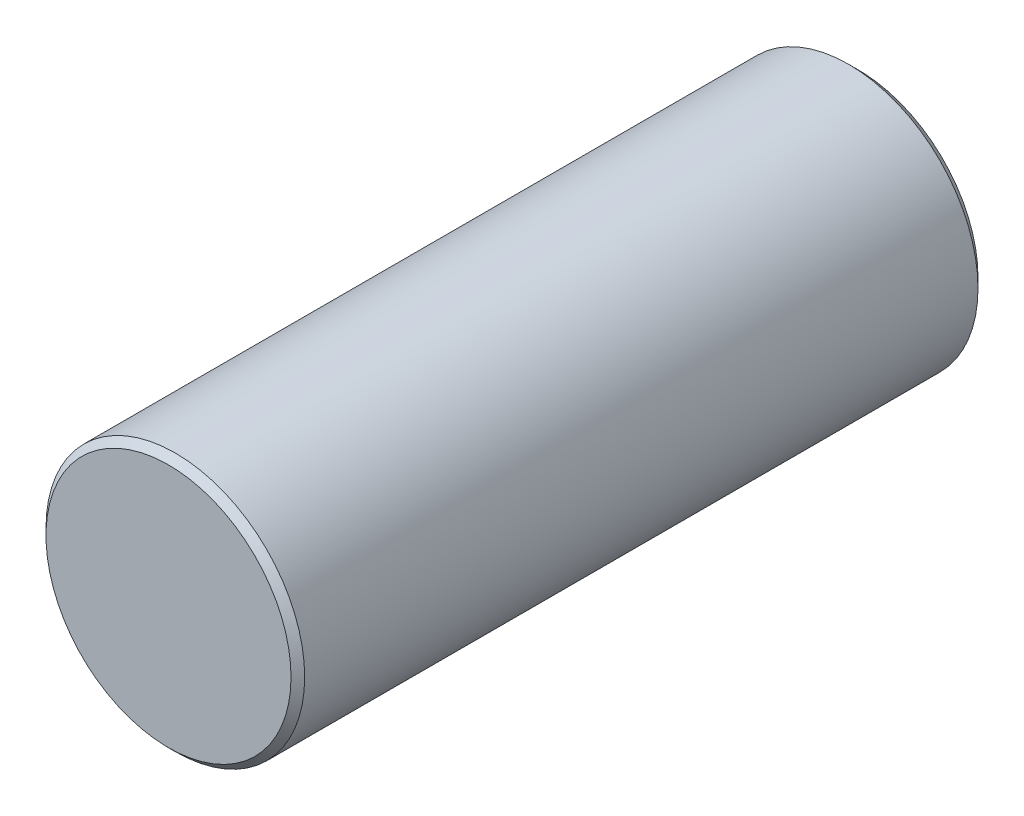
ISO-10303-21;
HEADER;
FILE_DESCRIPTION(('STEP AP214'),'2;1');
FILE_NAME('part.step','',(''),(''),'','','');
FILE_SCHEMA(('AUTOMOTIVE_DESIGN { 1 0 10303 214 1 1 1 1 }'));
ENDSEC;
DATA;
#1=APPLICATION_CONTEXT('core data for automotive mechanical design processes');
#2=APPLICATION_PROTOCOL_DEFINITION('international standard','automotive_design',2000,#1);
#3=PRODUCT_CONTEXT('',#1,'mechanical');
#4=PRODUCT('Part','Part','',(#3));
#5=PRODUCT_RELATED_PRODUCT_CATEGORY('part','',(#4));
#6=PRODUCT_DEFINITION_FORMATION('','',#4);
#7=PRODUCT_DEFINITION_CONTEXT('part definition',#1,'design');
#8=PRODUCT_DEFINITION('design','',#6,#7);
#9=PRODUCT_DEFINITION_SHAPE('','',#8);
#10=(LENGTH_UNIT() NAMED_UNIT(*) SI_UNIT(.MILLI.,.METRE.));
#11=(NAMED_UNIT(*) PLANE_ANGLE_UNIT() SI_UNIT($,.RADIAN.));
#12=(NAMED_UNIT(*) SI_UNIT($,.STERADIAN.) SOLID_ANGLE_UNIT());
#13=UNCERTAINTY_MEASURE_WITH_UNIT(LENGTH_MEASURE(1.E-05),#10,'distance_accuracy_value','');
#14=(GEOMETRIC_REPRESENTATION_CONTEXT(3) GLOBAL_UNCERTAINTY_ASSIGNED_CONTEXT((#13)) GLOBAL_UNIT_ASSIGNED_CONTEXT((#10,
#11,#12)) REPRESENTATION_CONTEXT('',''));
#15=CARTESIAN_POINT('',(0.,0.,0.));
#16=DIRECTION('',(0.,0.,1.));
#17=DIRECTION('',(1.,0.,0.));
#18=AXIS2_PLACEMENT_3D('',#15,#16,#17);
#19=CARTESIAN_POINT('',(0.,0.,12.7));
#20=DIRECTION('',(0.,0.,-1.));
#21=DIRECTION('',(-1.,0.,0.));
#22=AXIS2_PLACEMENT_3D('',#19,#20,#21);
#23=PLANE('',#22);
#24=CARTESIAN_POINT('',(0.,0.,12.7));
#25=DIRECTION('',(0.,0.,1.));
#26=DIRECTION('',(1.,0.,0.));
#27=AXIS2_PLACEMENT_3D('',#24,#25,#26);
#28=CIRCLE('',#27,4.5110528286101);
#29=CARTESIAN_POINT('',(4.5110528286101,0.,12.7));
#30=VERTEX_POINT('',#29);
#31=EDGE_CURVE('E10',#30,#30,#28,.T.);
#32=ORIENTED_EDGE('',*,*,#31,.T.);
#33=EDGE_LOOP('',(#32));
#34=FACE_BOUND('',#33,.T.);
#35=ADVANCED_FACE('F36',(#34),#23,.F.);
#36=CARTESIAN_POINT('',(0.,0.,12.44855282861));
#37=DIRECTION('',(0.,0.,-1.));
#38=DIRECTION('',(-1.,0.,0.));
#39=AXIS2_PLACEMENT_3D('',#36,#37,#38);
#40=CONICAL_SURFACE('',#39,4.7625,0.785398163397247);
#41=ORIENTED_EDGE('',*,*,#31,.F.);
#42=EDGE_LOOP('',(#41));
#43=FACE_BOUND('',#42,.T.);
#44=CARTESIAN_POINT('',(0.,0.,12.44855282861));
#45=DIRECTION('',(0.,0.,1.));
#46=DIRECTION('',(1.,0.,0.));
#47=AXIS2_PLACEMENT_3D('',#44,#45,#46);
#48=CIRCLE('',#47,4.7625);
#49=CARTESIAN_POINT('',(4.7625,0.,12.44855282861));
#50=VERTEX_POINT('',#49);
#51=EDGE_CURVE('E42',#50,#50,#48,.T.);
#52=ORIENTED_EDGE('',*,*,#51,.T.);
#53=EDGE_LOOP('',(#52));
#54=FACE_BOUND('',#53,.T.);
#55=ADVANCED_FACE('F68',(#43,#54),#40,.T.);
#56=CARTESIAN_POINT('',(0.,0.,-12.7));
#57=DIRECTION('',(0.,0.,1.));
#58=DIRECTION('',(1.,0.,0.));
#59=AXIS2_PLACEMENT_3D('',#56,#57,#58);
#60=CYLINDRICAL_SURFACE('',#59,4.7625);
#61=ORIENTED_EDGE('',*,*,#51,.F.);
#62=EDGE_LOOP('',(#61));
#63=FACE_BOUND('',#62,.T.);
#64=CARTESIAN_POINT('',(0.,0.,-12.3444));
#65=DIRECTION('',(0.,0.,1.));
#66=DIRECTION('',(1.,0.,0.));
#67=AXIS2_PLACEMENT_3D('',#64,#65,#66);
#68=CIRCLE('',#67,4.7625);
#69=CARTESIAN_POINT('',(4.7625,0.,-12.3444));
#70=VERTEX_POINT('',#69);
#71=EDGE_CURVE('E46',#70,#70,#68,.T.);
#72=ORIENTED_EDGE('',*,*,#71,.T.);
#73=EDGE_LOOP('',(#72));
#74=FACE_BOUND('',#73,.T.);
#75=ADVANCED_FACE('F64',(#63,#74),#60,.T.);
#76=CARTESIAN_POINT('',(0.,0.,-12.7));
#77=DIRECTION('',(0.,0.,1.));
#78=DIRECTION('',(1.,0.,0.));
#79=AXIS2_PLACEMENT_3D('',#76,#77,#78);
#80=CONICAL_SURFACE('',#79,4.4069,0.78539816339745);
#81=ORIENTED_EDGE('',*,*,#71,.F.);
#82=EDGE_LOOP('',(#81));
#83=FACE_BOUND('',#82,.T.);
#84=CARTESIAN_POINT('',(0.,0.,-12.7));
#85=DIRECTION('',(0.,0.,1.));
#86=DIRECTION('',(1.,0.,0.));
#87=AXIS2_PLACEMENT_3D('',#84,#85,#86);
#88=CIRCLE('',#87,4.4069);
#89=CARTESIAN_POINT('',(4.4069,0.,-12.7));
#90=VERTEX_POINT('',#89);
#91=EDGE_CURVE('E50',#90,#90,#88,.T.);
#92=ORIENTED_EDGE('',*,*,#91,.T.);
#93=EDGE_LOOP('',(#92));
#94=FACE_BOUND('',#93,.T.);
#95=ADVANCED_FACE('F56',(#83,#94),#80,.T.);
#96=CARTESIAN_POINT('',(0.,4.4069,-12.7));
#97=DIRECTION('',(0.,0.,1.));
#98=DIRECTION('',(1.,0.,0.));
#99=AXIS2_PLACEMENT_3D('',#96,#97,#98);
#100=PLANE('',#99);
#101=ORIENTED_EDGE('',*,*,#91,.F.);
#102=EDGE_LOOP('',(#101));
#103=FACE_BOUND('',#102,.T.);
#104=ADVANCED_FACE('F58',(#103),#100,.F.);
#105=CLOSED_SHELL('',(#35,#55,#75,#95,#104));
#106=MANIFOLD_SOLID_BREP('B2',#105);
#107=ADVANCED_BREP_SHAPE_REPRESENTATION('',(#18,#106),#14);
#108=SHAPE_DEFINITION_REPRESENTATION(#9,#107);
ENDSEC;
END-ISO-10303-21;
